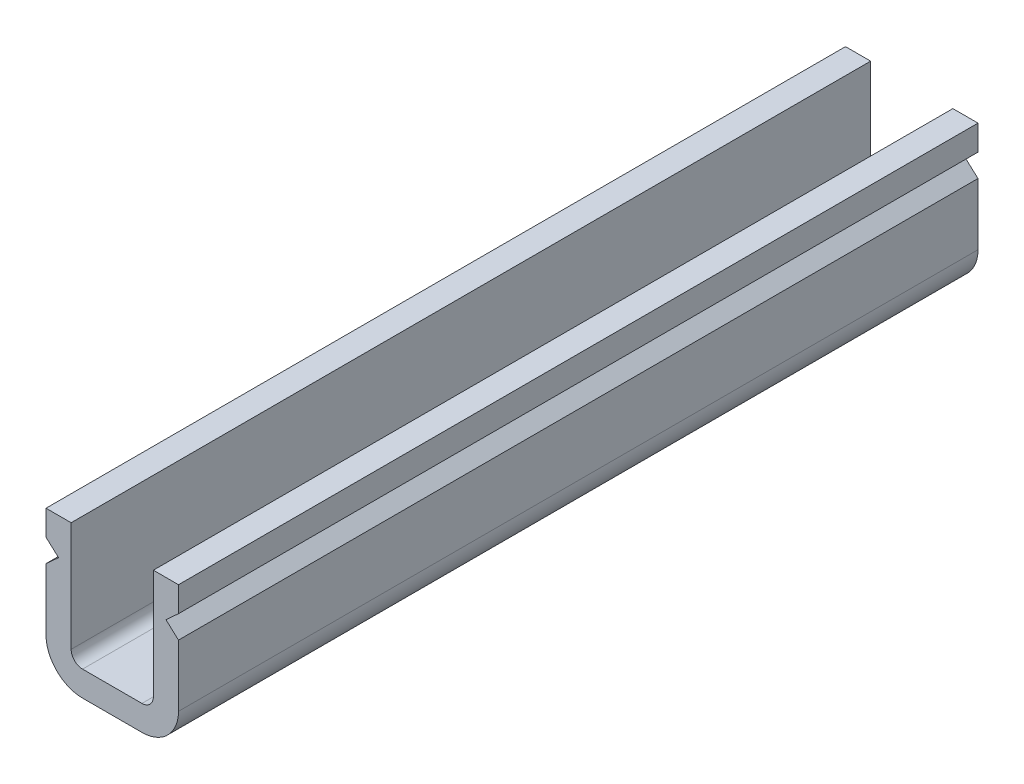
ISO-10303-21;
HEADER;
FILE_DESCRIPTION(('STEP AP214'),'2;1');
FILE_NAME('part.step','',(''),(''),'','','');
FILE_SCHEMA(('AUTOMOTIVE_DESIGN { 1 0 10303 214 1 1 1 1 }'));
ENDSEC;
DATA;
#1=APPLICATION_CONTEXT('core data for automotive mechanical design processes');
#2=APPLICATION_PROTOCOL_DEFINITION('international standard','automotive_design',2000,#1);
#3=PRODUCT_CONTEXT('',#1,'mechanical');
#4=PRODUCT('Part','Part','',(#3));
#5=PRODUCT_RELATED_PRODUCT_CATEGORY('part','',(#4));
#6=PRODUCT_DEFINITION_FORMATION('','',#4);
#7=PRODUCT_DEFINITION_CONTEXT('part definition',#1,'design');
#8=PRODUCT_DEFINITION('design','',#6,#7);
#9=PRODUCT_DEFINITION_SHAPE('','',#8);
#10=(LENGTH_UNIT() NAMED_UNIT(*) SI_UNIT(.MILLI.,.METRE.));
#11=(NAMED_UNIT(*) PLANE_ANGLE_UNIT() SI_UNIT($,.RADIAN.));
#12=(NAMED_UNIT(*) SI_UNIT($,.STERADIAN.) SOLID_ANGLE_UNIT());
#13=UNCERTAINTY_MEASURE_WITH_UNIT(LENGTH_MEASURE(1.E-05),#10,'distance_accuracy_value','');
#14=(GEOMETRIC_REPRESENTATION_CONTEXT(3) GLOBAL_UNCERTAINTY_ASSIGNED_CONTEXT((#13)) GLOBAL_UNIT_ASSIGNED_CONTEXT((#10,
#11,#12)) REPRESENTATION_CONTEXT('',''));
#15=CARTESIAN_POINT('',(0.,0.,0.));
#16=DIRECTION('',(0.,0.,1.));
#17=DIRECTION('',(1.,0.,0.));
#18=AXIS2_PLACEMENT_3D('',#15,#16,#17);
#19=CARTESIAN_POINT('',(3.2,-2.1,35.));
#20=DIRECTION('',(0.,-1.,0.));
#21=DIRECTION('',(0.,0.,-1.));
#22=AXIS2_PLACEMENT_3D('',#19,#20,#21);
#23=PLANE('',#22);
#24=DIRECTION('',(-1.,0.,0.));
#25=VECTOR('',#24,1.);
#26=CARTESIAN_POINT('',(3.2,-2.1,0.));
#27=LINE('',#26,#25);
#28=CARTESIAN_POINT('',(3.2,-2.1,0.));
#29=VERTEX_POINT('',#28);
#30=CARTESIAN_POINT('',(2.1,-2.1,0.));
#31=VERTEX_POINT('',#30);
#32=EDGE_CURVE('E186',#29,#31,#27,.T.);
#33=ORIENTED_EDGE('',*,*,#32,.T.);
#34=DIRECTION('',(0.,0.,-1.));
#35=VECTOR('',#34,1.);
#36=CARTESIAN_POINT('',(2.1,-2.1,35.));
#37=LINE('',#36,#35);
#38=CARTESIAN_POINT('',(2.1,-2.1,35.));
#39=VERTEX_POINT('',#38);
#40=EDGE_CURVE('E11',#39,#31,#37,.T.);
#41=ORIENTED_EDGE('',*,*,#40,.F.);
#42=DIRECTION('',(-1.,0.,0.));
#43=VECTOR('',#42,1.);
#44=CARTESIAN_POINT('',(3.2,-2.1,35.));
#45=LINE('',#44,#43);
#46=CARTESIAN_POINT('',(3.2,-2.1,35.));
#47=VERTEX_POINT('',#46);
#48=EDGE_CURVE('E220',#47,#39,#45,.T.);
#49=ORIENTED_EDGE('',*,*,#48,.F.);
#50=DIRECTION('',(0.,0.,-1.));
#51=VECTOR('',#50,1.);
#52=CARTESIAN_POINT('',(3.2,-2.1,35.));
#53=LINE('',#52,#51);
#54=EDGE_CURVE('E182',#47,#29,#53,.T.);
#55=ORIENTED_EDGE('',*,*,#54,.T.);
#56=EDGE_LOOP('',(#33,#41,#49,#55));
#57=FACE_BOUND('',#56,.T.);
#58=ADVANCED_FACE('F30',(#57),#23,.F.);
#59=CARTESIAN_POINT('',(2.1,-2.1,35.));
#60=DIRECTION('',(1.,0.,0.));
#61=DIRECTION('',(0.,1.,0.));
#62=AXIS2_PLACEMENT_3D('',#59,#60,#61);
#63=PLANE('',#62);
#64=DIRECTION('',(0.,-1.,0.));
#65=VECTOR('',#64,1.);
#66=CARTESIAN_POINT('',(2.1,-2.1,0.));
#67=LINE('',#66,#65);
#68=CARTESIAN_POINT('',(2.10000000000001,-3.2,0.));
#69=VERTEX_POINT('',#68);
#70=EDGE_CURVE('E189',#31,#69,#67,.T.);
#71=ORIENTED_EDGE('',*,*,#70,.T.);
#72=DIRECTION('',(0.,0.,-1.));
#73=VECTOR('',#72,1.);
#74=CARTESIAN_POINT('',(2.10000000000001,-3.2,35.));
#75=LINE('',#74,#73);
#76=CARTESIAN_POINT('',(2.10000000000001,-3.2,35.));
#77=VERTEX_POINT('',#76);
#78=EDGE_CURVE('E38',#77,#69,#75,.T.);
#79=ORIENTED_EDGE('',*,*,#78,.F.);
#80=DIRECTION('',(0.,-1.,0.));
#81=VECTOR('',#80,1.);
#82=CARTESIAN_POINT('',(2.1,-2.1,35.));
#83=LINE('',#82,#81);
#84=EDGE_CURVE('E119',#39,#77,#83,.T.);
#85=ORIENTED_EDGE('',*,*,#84,.F.);
#86=ORIENTED_EDGE('',*,*,#40,.T.);
#87=EDGE_LOOP('',(#71,#79,#85,#86));
#88=FACE_BOUND('',#87,.T.);
#89=ADVANCED_FACE('F328',(#88),#63,.F.);
#90=CARTESIAN_POINT('',(2.10000000000001,-3.2,35.));
#91=DIRECTION('',(0.672672793996314,0.739940073395943,0.));
#92=DIRECTION('',(-0.739940073395943,0.672672793996314,0.));
#93=AXIS2_PLACEMENT_3D('',#90,#91,#92);
#94=PLANE('',#93);
#95=DIRECTION('',(0.739940073395943,-0.672672793996314,0.));
#96=VECTOR('',#95,1.);
#97=CARTESIAN_POINT('',(2.10000000000001,-3.2,0.));
#98=LINE('',#97,#96);
#99=CARTESIAN_POINT('',(2.65,-3.7,0.));
#100=VERTEX_POINT('',#99);
#101=EDGE_CURVE('E191',#69,#100,#98,.T.);
#102=ORIENTED_EDGE('',*,*,#101,.T.);
#103=DIRECTION('',(0.,0.,-1.));
#104=VECTOR('',#103,1.);
#105=CARTESIAN_POINT('',(2.65,-3.7,35.));
#106=LINE('',#105,#104);
#107=CARTESIAN_POINT('',(2.65,-3.7,35.));
#108=VERTEX_POINT('',#107);
#109=EDGE_CURVE('E257',#108,#100,#106,.T.);
#110=ORIENTED_EDGE('',*,*,#109,.F.);
#111=DIRECTION('',(0.739940073395943,-0.672672793996314,0.));
#112=VECTOR('',#111,1.);
#113=CARTESIAN_POINT('',(2.10000000000001,-3.2,35.));
#114=LINE('',#113,#112);
#115=EDGE_CURVE('E265',#77,#108,#114,.T.);
#116=ORIENTED_EDGE('',*,*,#115,.F.);
#117=ORIENTED_EDGE('',*,*,#78,.T.);
#118=EDGE_LOOP('',(#102,#110,#116,#117));
#119=FACE_BOUND('',#118,.T.);
#120=ADVANCED_FACE('F263',(#119),#94,.F.);
#121=CARTESIAN_POINT('',(2.10000000000001,-4.2,35.));
#122=DIRECTION('',(0.672672793996314,-0.739940073395943,0.));
#123=DIRECTION('',(0.739940073395943,0.672672793996314,0.));
#124=AXIS2_PLACEMENT_3D('',#121,#122,#123);
#125=PLANE('',#124);
#126=DIRECTION('',(-0.739940073395943,-0.672672793996314,0.));
#127=VECTOR('',#126,1.);
#128=CARTESIAN_POINT('',(2.10000000000001,-4.2,0.));
#129=LINE('',#128,#127);
#130=CARTESIAN_POINT('',(2.10000000000001,-4.2,0.));
#131=VERTEX_POINT('',#130);
#132=EDGE_CURVE('E193',#100,#131,#129,.T.);
#133=ORIENTED_EDGE('',*,*,#132,.T.);
#134=DIRECTION('',(0.,0.,-1.));
#135=VECTOR('',#134,1.);
#136=CARTESIAN_POINT('',(2.10000000000001,-4.2,35.));
#137=LINE('',#136,#135);
#138=CARTESIAN_POINT('',(2.10000000000001,-4.2,35.));
#139=VERTEX_POINT('',#138);
#140=EDGE_CURVE('E254',#139,#131,#137,.T.);
#141=ORIENTED_EDGE('',*,*,#140,.F.);
#142=DIRECTION('',(-0.739940073395943,-0.672672793996314,0.));
#143=VECTOR('',#142,1.);
#144=CARTESIAN_POINT('',(2.10000000000001,-4.2,35.));
#145=LINE('',#144,#143);
#146=EDGE_CURVE('E283',#108,#139,#145,.T.);
#147=ORIENTED_EDGE('',*,*,#146,.F.);
#148=ORIENTED_EDGE('',*,*,#109,.T.);
#149=EDGE_LOOP('',(#133,#141,#147,#148));
#150=FACE_BOUND('',#149,.T.);
#151=ADVANCED_FACE('F274',(#150),#125,.F.);
#152=CARTESIAN_POINT('',(2.10000000000001,-4.2,35.));
#153=DIRECTION('',(1.,0.,0.));
#154=DIRECTION('',(0.,1.,0.));
#155=AXIS2_PLACEMENT_3D('',#152,#153,#154);
#156=PLANE('',#155);
#157=DIRECTION('',(0.,-1.,0.));
#158=VECTOR('',#157,1.);
#159=CARTESIAN_POINT('',(2.10000000000001,-4.2,0.));
#160=LINE('',#159,#158);
#161=CARTESIAN_POINT('',(2.1,-6.89999999999999,0.));
#162=VERTEX_POINT('',#161);
#163=EDGE_CURVE('E195',#131,#162,#160,.T.);
#164=ORIENTED_EDGE('',*,*,#163,.T.);
#165=DIRECTION('',(0.,0.,-1.));
#166=VECTOR('',#165,1.);
#167=CARTESIAN_POINT('',(2.1,-6.89999999999999,35.));
#168=LINE('',#167,#166);
#169=CARTESIAN_POINT('',(2.1,-6.89999999999999,35.));
#170=VERTEX_POINT('',#169);
#171=EDGE_CURVE('E251',#170,#162,#168,.T.);
#172=ORIENTED_EDGE('',*,*,#171,.F.);
#173=DIRECTION('',(0.,-1.,0.));
#174=VECTOR('',#173,1.);
#175=CARTESIAN_POINT('',(2.10000000000001,-4.2,35.));
#176=LINE('',#175,#174);
#177=EDGE_CURVE('E280',#139,#170,#176,.T.);
#178=ORIENTED_EDGE('',*,*,#177,.F.);
#179=ORIENTED_EDGE('',*,*,#140,.T.);
#180=EDGE_LOOP('',(#164,#172,#178,#179));
#181=FACE_BOUND('',#180,.T.);
#182=ADVANCED_FACE('F278',(#181),#156,.F.);
#183=CARTESIAN_POINT('',(3.7,-6.9,35.));
#184=DIRECTION('',(0.,0.,-1.));
#185=DIRECTION('',(-1.,0.,0.));
#186=AXIS2_PLACEMENT_3D('',#183,#184,#185);
#187=CYLINDRICAL_SURFACE('',#186,1.6);
#188=CARTESIAN_POINT('',(3.7,-6.9,0.));
#189=DIRECTION('',(0.,0.,1.));
#190=DIRECTION('',(1.,0.,0.));
#191=AXIS2_PLACEMENT_3D('',#188,#189,#190);
#192=CIRCLE('',#191,1.6);
#193=CARTESIAN_POINT('',(3.70000000000001,-8.5,0.));
#194=VERTEX_POINT('',#193);
#195=EDGE_CURVE('E197',#162,#194,#192,.T.);
#196=ORIENTED_EDGE('',*,*,#195,.T.);
#197=DIRECTION('',(0.,0.,-1.));
#198=VECTOR('',#197,1.);
#199=CARTESIAN_POINT('',(3.70000000000001,-8.5,35.));
#200=LINE('',#199,#198);
#201=CARTESIAN_POINT('',(3.70000000000001,-8.5,35.));
#202=VERTEX_POINT('',#201);
#203=EDGE_CURVE('E248',#202,#194,#200,.T.);
#204=ORIENTED_EDGE('',*,*,#203,.F.);
#205=CARTESIAN_POINT('',(3.7,-6.9,35.));
#206=DIRECTION('',(0.,0.,1.));
#207=DIRECTION('',(1.,0.,0.));
#208=AXIS2_PLACEMENT_3D('',#205,#206,#207);
#209=CIRCLE('',#208,1.6);
#210=EDGE_CURVE('E282',#170,#202,#209,.T.);
#211=ORIENTED_EDGE('',*,*,#210,.F.);
#212=ORIENTED_EDGE('',*,*,#171,.T.);
#213=EDGE_LOOP('',(#196,#204,#211,#212));
#214=FACE_BOUND('',#213,.T.);
#215=ADVANCED_FACE('F341',(#214),#187,.T.);
#216=CARTESIAN_POINT('',(3.70000000000001,-8.5,35.));
#217=DIRECTION('',(0.,1.,0.));
#218=DIRECTION('',(0.,0.,1.));
#219=AXIS2_PLACEMENT_3D('',#216,#217,#218);
#220=PLANE('',#219);
#221=DIRECTION('',(1.,0.,0.));
#222=VECTOR('',#221,1.);
#223=CARTESIAN_POINT('',(3.70000000000001,-8.5,0.));
#224=LINE('',#223,#222);
#225=CARTESIAN_POINT('',(6.29999999999999,-8.5,0.));
#226=VERTEX_POINT('',#225);
#227=EDGE_CURVE('E199',#194,#226,#224,.T.);
#228=ORIENTED_EDGE('',*,*,#227,.T.);
#229=DIRECTION('',(0.,0.,-1.));
#230=VECTOR('',#229,1.);
#231=CARTESIAN_POINT('',(6.29999999999999,-8.5,35.));
#232=LINE('',#231,#230);
#233=CARTESIAN_POINT('',(6.29999999999999,-8.5,35.));
#234=VERTEX_POINT('',#233);
#235=EDGE_CURVE('E245',#234,#226,#232,.T.);
#236=ORIENTED_EDGE('',*,*,#235,.F.);
#237=DIRECTION('',(1.,0.,0.));
#238=VECTOR('',#237,1.);
#239=CARTESIAN_POINT('',(3.70000000000001,-8.5,35.));
#240=LINE('',#239,#238);
#241=EDGE_CURVE('E285',#202,#234,#240,.T.);
#242=ORIENTED_EDGE('',*,*,#241,.F.);
#243=ORIENTED_EDGE('',*,*,#203,.T.);
#244=EDGE_LOOP('',(#228,#236,#242,#243));
#245=FACE_BOUND('',#244,.T.);
#246=ADVANCED_FACE('F344',(#245),#220,.F.);
#247=CARTESIAN_POINT('',(6.3,-6.9,35.));
#248=DIRECTION('',(0.,0.,-1.));
#249=DIRECTION('',(-1.,0.,0.));
#250=AXIS2_PLACEMENT_3D('',#247,#248,#249);
#251=CYLINDRICAL_SURFACE('',#250,1.6);
#252=CARTESIAN_POINT('',(6.3,-6.9,0.));
#253=DIRECTION('',(0.,0.,1.));
#254=DIRECTION('',(1.,0.,0.));
#255=AXIS2_PLACEMENT_3D('',#252,#253,#254);
#256=CIRCLE('',#255,1.6);
#257=CARTESIAN_POINT('',(7.9,-6.89999999999999,0.));
#258=VERTEX_POINT('',#257);
#259=EDGE_CURVE('E201',#226,#258,#256,.T.);
#260=ORIENTED_EDGE('',*,*,#259,.T.);
#261=DIRECTION('',(0.,0.,-1.));
#262=VECTOR('',#261,1.);
#263=CARTESIAN_POINT('',(7.9,-6.89999999999999,35.));
#264=LINE('',#263,#262);
#265=CARTESIAN_POINT('',(7.9,-6.89999999999999,35.));
#266=VERTEX_POINT('',#265);
#267=EDGE_CURVE('E242',#266,#258,#264,.T.);
#268=ORIENTED_EDGE('',*,*,#267,.F.);
#269=CARTESIAN_POINT('',(6.3,-6.9,35.));
#270=DIRECTION('',(0.,0.,1.));
#271=DIRECTION('',(1.,0.,0.));
#272=AXIS2_PLACEMENT_3D('',#269,#270,#271);
#273=CIRCLE('',#272,1.6);
#274=EDGE_CURVE('E291',#234,#266,#273,.T.);
#275=ORIENTED_EDGE('',*,*,#274,.F.);
#276=ORIENTED_EDGE('',*,*,#235,.T.);
#277=EDGE_LOOP('',(#260,#268,#275,#276));
#278=FACE_BOUND('',#277,.T.);
#279=ADVANCED_FACE('F348',(#278),#251,.T.);
#280=CARTESIAN_POINT('',(7.9,-6.89999999999999,35.));
#281=DIRECTION('',(-1.,0.,0.));
#282=DIRECTION('',(0.,-1.,0.));
#283=AXIS2_PLACEMENT_3D('',#280,#281,#282);
#284=PLANE('',#283);
#285=DIRECTION('',(0.,1.,0.));
#286=VECTOR('',#285,1.);
#287=CARTESIAN_POINT('',(7.9,-6.89999999999999,0.));
#288=LINE('',#287,#286);
#289=CARTESIAN_POINT('',(7.9,-4.2,0.));
#290=VERTEX_POINT('',#289);
#291=EDGE_CURVE('E203',#258,#290,#288,.T.);
#292=ORIENTED_EDGE('',*,*,#291,.T.);
#293=DIRECTION('',(0.,0.,-1.));
#294=VECTOR('',#293,1.);
#295=CARTESIAN_POINT('',(7.9,-4.2,35.));
#296=LINE('',#295,#294);
#297=CARTESIAN_POINT('',(7.9,-4.2,35.));
#298=VERTEX_POINT('',#297);
#299=EDGE_CURVE('E239',#298,#290,#296,.T.);
#300=ORIENTED_EDGE('',*,*,#299,.F.);
#301=DIRECTION('',(0.,1.,0.));
#302=VECTOR('',#301,1.);
#303=CARTESIAN_POINT('',(7.9,-6.89999999999999,35.));
#304=LINE('',#303,#302);
#305=EDGE_CURVE('E293',#266,#298,#304,.T.);
#306=ORIENTED_EDGE('',*,*,#305,.F.);
#307=ORIENTED_EDGE('',*,*,#267,.T.);
#308=EDGE_LOOP('',(#292,#300,#306,#307));
#309=FACE_BOUND('',#308,.T.);
#310=ADVANCED_FACE('F352',(#309),#284,.F.);
#311=CARTESIAN_POINT('',(7.9,-4.2,35.));
#312=DIRECTION('',(-0.672672793996314,-0.739940073395943,0.));
#313=DIRECTION('',(0.739940073395943,-0.672672793996314,0.));
#314=AXIS2_PLACEMENT_3D('',#311,#312,#313);
#315=PLANE('',#314);
#316=DIRECTION('',(-0.739940073395943,0.672672793996314,0.));
#317=VECTOR('',#316,1.);
#318=CARTESIAN_POINT('',(7.9,-4.2,0.));
#319=LINE('',#318,#317);
#320=CARTESIAN_POINT('',(7.35,-3.7,0.));
#321=VERTEX_POINT('',#320);
#322=EDGE_CURVE('E205',#290,#321,#319,.T.);
#323=ORIENTED_EDGE('',*,*,#322,.T.);
#324=DIRECTION('',(0.,0.,-1.));
#325=VECTOR('',#324,1.);
#326=CARTESIAN_POINT('',(7.35,-3.7,35.));
#327=LINE('',#326,#325);
#328=CARTESIAN_POINT('',(7.35,-3.7,35.));
#329=VERTEX_POINT('',#328);
#330=EDGE_CURVE('E236',#329,#321,#327,.T.);
#331=ORIENTED_EDGE('',*,*,#330,.F.);
#332=DIRECTION('',(-0.739940073395943,0.672672793996314,0.));
#333=VECTOR('',#332,1.);
#334=CARTESIAN_POINT('',(7.9,-4.2,35.));
#335=LINE('',#334,#333);
#336=EDGE_CURVE('E295',#298,#329,#335,.T.);
#337=ORIENTED_EDGE('',*,*,#336,.F.);
#338=ORIENTED_EDGE('',*,*,#299,.T.);
#339=EDGE_LOOP('',(#323,#331,#337,#338));
#340=FACE_BOUND('',#339,.T.);
#341=ADVANCED_FACE('F356',(#340),#315,.F.);
#342=CARTESIAN_POINT('',(7.9,-3.2,35.));
#343=DIRECTION('',(-0.672672793996314,0.739940073395943,0.));
#344=DIRECTION('',(-0.739940073395943,-0.672672793996314,0.));
#345=AXIS2_PLACEMENT_3D('',#342,#343,#344);
#346=PLANE('',#345);
#347=DIRECTION('',(0.739940073395943,0.672672793996314,0.));
#348=VECTOR('',#347,1.);
#349=CARTESIAN_POINT('',(7.9,-3.2,0.));
#350=LINE('',#349,#348);
#351=CARTESIAN_POINT('',(7.9,-3.2,0.));
#352=VERTEX_POINT('',#351);
#353=EDGE_CURVE('E207',#321,#352,#350,.T.);
#354=ORIENTED_EDGE('',*,*,#353,.T.);
#355=DIRECTION('',(0.,0.,-1.));
#356=VECTOR('',#355,1.);
#357=CARTESIAN_POINT('',(7.9,-3.2,35.));
#358=LINE('',#357,#356);
#359=CARTESIAN_POINT('',(7.9,-3.2,35.));
#360=VERTEX_POINT('',#359);
#361=EDGE_CURVE('E233',#360,#352,#358,.T.);
#362=ORIENTED_EDGE('',*,*,#361,.F.);
#363=DIRECTION('',(0.739940073395943,0.672672793996314,0.));
#364=VECTOR('',#363,1.);
#365=CARTESIAN_POINT('',(7.9,-3.2,35.));
#366=LINE('',#365,#364);
#367=EDGE_CURVE('E297',#329,#360,#366,.T.);
#368=ORIENTED_EDGE('',*,*,#367,.F.);
#369=ORIENTED_EDGE('',*,*,#330,.T.);
#370=EDGE_LOOP('',(#354,#362,#368,#369));
#371=FACE_BOUND('',#370,.T.);
#372=ADVANCED_FACE('F360',(#371),#346,.F.);
#373=CARTESIAN_POINT('',(7.9,-3.2,35.));
#374=DIRECTION('',(-1.,0.,0.));
#375=DIRECTION('',(0.,-1.,0.));
#376=AXIS2_PLACEMENT_3D('',#373,#374,#375);
#377=PLANE('',#376);
#378=DIRECTION('',(0.,1.,0.));
#379=VECTOR('',#378,1.);
#380=CARTESIAN_POINT('',(7.9,-3.2,0.));
#381=LINE('',#380,#379);
#382=CARTESIAN_POINT('',(7.9,-2.1,0.));
#383=VERTEX_POINT('',#382);
#384=EDGE_CURVE('E209',#352,#383,#381,.T.);
#385=ORIENTED_EDGE('',*,*,#384,.T.);
#386=DIRECTION('',(0.,0.,-1.));
#387=VECTOR('',#386,1.);
#388=CARTESIAN_POINT('',(7.9,-2.1,35.));
#389=LINE('',#388,#387);
#390=CARTESIAN_POINT('',(7.9,-2.1,35.));
#391=VERTEX_POINT('',#390);
#392=EDGE_CURVE('E230',#391,#383,#389,.T.);
#393=ORIENTED_EDGE('',*,*,#392,.F.);
#394=DIRECTION('',(0.,1.,0.));
#395=VECTOR('',#394,1.);
#396=CARTESIAN_POINT('',(7.9,-3.2,35.));
#397=LINE('',#396,#395);
#398=EDGE_CURVE('E299',#360,#391,#397,.T.);
#399=ORIENTED_EDGE('',*,*,#398,.F.);
#400=ORIENTED_EDGE('',*,*,#361,.T.);
#401=EDGE_LOOP('',(#385,#393,#399,#400));
#402=FACE_BOUND('',#401,.T.);
#403=ADVANCED_FACE('F364',(#402),#377,.F.);
#404=CARTESIAN_POINT('',(7.9,-2.1,35.));
#405=DIRECTION('',(0.,-1.,0.));
#406=DIRECTION('',(1.,0.,0.));
#407=AXIS2_PLACEMENT_3D('',#404,#405,#406);
#408=PLANE('',#407);
#409=DIRECTION('',(-1.,0.,0.));
#410=VECTOR('',#409,1.);
#411=CARTESIAN_POINT('',(7.9,-2.1,0.));
#412=LINE('',#411,#410);
#413=CARTESIAN_POINT('',(6.8,-2.1,0.));
#414=VERTEX_POINT('',#413);
#415=EDGE_CURVE('E211',#383,#414,#412,.T.);
#416=ORIENTED_EDGE('',*,*,#415,.T.);
#417=DIRECTION('',(0.,0.,-1.));
#418=VECTOR('',#417,1.);
#419=CARTESIAN_POINT('',(6.8,-2.1,35.));
#420=LINE('',#419,#418);
#421=CARTESIAN_POINT('',(6.8,-2.1,35.));
#422=VERTEX_POINT('',#421);
#423=EDGE_CURVE('E227',#422,#414,#420,.T.);
#424=ORIENTED_EDGE('',*,*,#423,.F.);
#425=DIRECTION('',(-1.,0.,0.));
#426=VECTOR('',#425,1.);
#427=CARTESIAN_POINT('',(7.9,-2.1,35.));
#428=LINE('',#427,#426);
#429=EDGE_CURVE('E301',#391,#422,#428,.T.);
#430=ORIENTED_EDGE('',*,*,#429,.F.);
#431=ORIENTED_EDGE('',*,*,#392,.T.);
#432=EDGE_LOOP('',(#416,#424,#430,#431));
#433=FACE_BOUND('',#432,.T.);
#434=ADVANCED_FACE('F368',(#433),#408,.F.);
#435=CARTESIAN_POINT('',(6.8,-6.9,35.));
#436=DIRECTION('',(1.,0.,0.));
#437=DIRECTION('',(0.,0.,-1.));
#438=AXIS2_PLACEMENT_3D('',#435,#436,#437);
#439=PLANE('',#438);
#440=DIRECTION('',(0.,-1.,0.));
#441=VECTOR('',#440,1.);
#442=CARTESIAN_POINT('',(6.8,-6.9,0.));
#443=LINE('',#442,#441);
#444=CARTESIAN_POINT('',(6.8,-6.9,0.));
#445=VERTEX_POINT('',#444);
#446=EDGE_CURVE('E213',#414,#445,#443,.T.);
#447=ORIENTED_EDGE('',*,*,#446,.T.);
#448=DIRECTION('',(0.,0.,-1.));
#449=VECTOR('',#448,1.);
#450=CARTESIAN_POINT('',(6.8,-6.9,35.));
#451=LINE('',#450,#449);
#452=CARTESIAN_POINT('',(6.8,-6.9,35.));
#453=VERTEX_POINT('',#452);
#454=EDGE_CURVE('E224',#453,#445,#451,.T.);
#455=ORIENTED_EDGE('',*,*,#454,.F.);
#456=DIRECTION('',(0.,-1.,0.));
#457=VECTOR('',#456,1.);
#458=CARTESIAN_POINT('',(6.8,-6.9,35.));
#459=LINE('',#458,#457);
#460=EDGE_CURVE('E303',#422,#453,#459,.T.);
#461=ORIENTED_EDGE('',*,*,#460,.F.);
#462=ORIENTED_EDGE('',*,*,#423,.T.);
#463=EDGE_LOOP('',(#447,#455,#461,#462));
#464=FACE_BOUND('',#463,.T.);
#465=ADVANCED_FACE('F309',(#464),#439,.F.);
#466=CARTESIAN_POINT('',(6.3,-6.9,35.));
#467=DIRECTION('',(0.,0.,-1.));
#468=DIRECTION('',(-1.,0.,0.));
#469=AXIS2_PLACEMENT_3D('',#466,#467,#468);
#470=CYLINDRICAL_SURFACE('',#469,0.5);
#471=CARTESIAN_POINT('',(6.3,-6.9,0.));
#472=DIRECTION('',(0.,0.,-1.));
#473=DIRECTION('',(-1.,0.,0.));
#474=AXIS2_PLACEMENT_3D('',#471,#472,#473);
#475=CIRCLE('',#474,0.5);
#476=CARTESIAN_POINT('',(6.3,-7.4,0.));
#477=VERTEX_POINT('',#476);
#478=EDGE_CURVE('E215',#445,#477,#475,.T.);
#479=ORIENTED_EDGE('',*,*,#478,.T.);
#480=DIRECTION('',(0.,0.,-1.));
#481=VECTOR('',#480,1.);
#482=CARTESIAN_POINT('',(6.3,-7.4,35.));
#483=LINE('',#482,#481);
#484=CARTESIAN_POINT('',(6.3,-7.4,35.));
#485=VERTEX_POINT('',#484);
#486=EDGE_CURVE('E177',#485,#477,#483,.T.);
#487=ORIENTED_EDGE('',*,*,#486,.F.);
#488=CARTESIAN_POINT('',(6.3,-6.9,35.));
#489=DIRECTION('',(0.,0.,-1.));
#490=DIRECTION('',(-1.,0.,0.));
#491=AXIS2_PLACEMENT_3D('',#488,#489,#490);
#492=CIRCLE('',#491,0.5);
#493=EDGE_CURVE('E168',#453,#485,#492,.T.);
#494=ORIENTED_EDGE('',*,*,#493,.F.);
#495=ORIENTED_EDGE('',*,*,#454,.T.);
#496=EDGE_LOOP('',(#479,#487,#494,#495));
#497=FACE_BOUND('',#496,.T.);
#498=ADVANCED_FACE('F313',(#497),#470,.F.);
#499=CARTESIAN_POINT('',(3.7,-7.4,35.));
#500=DIRECTION('',(0.,-1.,0.));
#501=DIRECTION('',(0.,0.,-1.));
#502=AXIS2_PLACEMENT_3D('',#499,#500,#501);
#503=PLANE('',#502);
#504=DIRECTION('',(-1.,0.,0.));
#505=VECTOR('',#504,1.);
#506=CARTESIAN_POINT('',(3.7,-7.4,0.));
#507=LINE('',#506,#505);
#508=CARTESIAN_POINT('',(3.7,-7.4,0.));
#509=VERTEX_POINT('',#508);
#510=EDGE_CURVE('E176',#477,#509,#507,.T.);
#511=ORIENTED_EDGE('',*,*,#510,.T.);
#512=DIRECTION('',(0.,0.,-1.));
#513=VECTOR('',#512,1.);
#514=CARTESIAN_POINT('',(3.7,-7.4,35.));
#515=LINE('',#514,#513);
#516=CARTESIAN_POINT('',(3.7,-7.4,35.));
#517=VERTEX_POINT('',#516);
#518=EDGE_CURVE('E173',#517,#509,#515,.T.);
#519=ORIENTED_EDGE('',*,*,#518,.F.);
#520=DIRECTION('',(-1.,0.,0.));
#521=VECTOR('',#520,1.);
#522=CARTESIAN_POINT('',(3.7,-7.4,35.));
#523=LINE('',#522,#521);
#524=EDGE_CURVE('E162',#485,#517,#523,.T.);
#525=ORIENTED_EDGE('',*,*,#524,.F.);
#526=ORIENTED_EDGE('',*,*,#486,.T.);
#527=EDGE_LOOP('',(#511,#519,#525,#526));
#528=FACE_BOUND('',#527,.T.);
#529=ADVANCED_FACE('F174',(#528),#503,.F.);
#530=CARTESIAN_POINT('',(3.7,-6.9,35.));
#531=DIRECTION('',(0.,0.,-1.));
#532=DIRECTION('',(-1.,0.,0.));
#533=AXIS2_PLACEMENT_3D('',#530,#531,#532);
#534=CYLINDRICAL_SURFACE('',#533,0.5);
#535=CARTESIAN_POINT('',(3.7,-6.9,0.));
#536=DIRECTION('',(0.,0.,-1.));
#537=DIRECTION('',(1.,0.,0.));
#538=AXIS2_PLACEMENT_3D('',#535,#536,#537);
#539=CIRCLE('',#538,0.5);
#540=CARTESIAN_POINT('',(3.2,-6.9,0.));
#541=VERTEX_POINT('',#540);
#542=EDGE_CURVE('E105',#509,#541,#539,.T.);
#543=ORIENTED_EDGE('',*,*,#542,.T.);
#544=DIRECTION('',(0.,0.,-1.));
#545=VECTOR('',#544,1.);
#546=CARTESIAN_POINT('',(3.2,-6.9,35.));
#547=LINE('',#546,#545);
#548=CARTESIAN_POINT('',(3.2,-6.9,35.));
#549=VERTEX_POINT('',#548);
#550=EDGE_CURVE('E178',#549,#541,#547,.T.);
#551=ORIENTED_EDGE('',*,*,#550,.F.);
#552=CARTESIAN_POINT('',(3.7,-6.9,35.));
#553=DIRECTION('',(0.,0.,-1.));
#554=DIRECTION('',(1.,0.,0.));
#555=AXIS2_PLACEMENT_3D('',#552,#553,#554);
#556=CIRCLE('',#555,0.5);
#557=EDGE_CURVE('E166',#517,#549,#556,.T.);
#558=ORIENTED_EDGE('',*,*,#557,.F.);
#559=ORIENTED_EDGE('',*,*,#518,.T.);
#560=EDGE_LOOP('',(#543,#551,#558,#559));
#561=FACE_BOUND('',#560,.T.);
#562=ADVANCED_FACE('F180',(#561),#534,.F.);
#563=CARTESIAN_POINT('',(3.2,-2.1,35.));
#564=DIRECTION('',(-1.,0.,0.));
#565=DIRECTION('',(0.,0.,1.));
#566=AXIS2_PLACEMENT_3D('',#563,#564,#565);
#567=PLANE('',#566);
#568=DIRECTION('',(0.,1.,0.));
#569=VECTOR('',#568,1.);
#570=CARTESIAN_POINT('',(3.2,-2.1,0.));
#571=LINE('',#570,#569);
#572=EDGE_CURVE('E111',#541,#29,#571,.T.);
#573=ORIENTED_EDGE('',*,*,#572,.T.);
#574=ORIENTED_EDGE('',*,*,#54,.F.);
#575=DIRECTION('',(0.,1.,0.));
#576=VECTOR('',#575,1.);
#577=CARTESIAN_POINT('',(3.2,-2.1,35.));
#578=LINE('',#577,#576);
#579=EDGE_CURVE('E46',#549,#47,#578,.T.);
#580=ORIENTED_EDGE('',*,*,#579,.F.);
#581=ORIENTED_EDGE('',*,*,#550,.T.);
#582=EDGE_LOOP('',(#573,#574,#580,#581));
#583=FACE_BOUND('',#582,.T.);
#584=ADVANCED_FACE('F317',(#583),#567,.F.);
#585=CARTESIAN_POINT('',(3.7,-6.9,35.));
#586=DIRECTION('',(0.,0.,1.));
#587=DIRECTION('',(1.,0.,0.));
#588=AXIS2_PLACEMENT_3D('',#585,#586,#587);
#589=PLANE('',#588);
#590=ORIENTED_EDGE('',*,*,#48,.T.);
#591=ORIENTED_EDGE('',*,*,#84,.T.);
#592=ORIENTED_EDGE('',*,*,#115,.T.);
#593=ORIENTED_EDGE('',*,*,#146,.T.);
#594=ORIENTED_EDGE('',*,*,#177,.T.);
#595=ORIENTED_EDGE('',*,*,#210,.T.);
#596=ORIENTED_EDGE('',*,*,#241,.T.);
#597=ORIENTED_EDGE('',*,*,#274,.T.);
#598=ORIENTED_EDGE('',*,*,#305,.T.);
#599=ORIENTED_EDGE('',*,*,#336,.T.);
#600=ORIENTED_EDGE('',*,*,#367,.T.);
#601=ORIENTED_EDGE('',*,*,#398,.T.);
#602=ORIENTED_EDGE('',*,*,#429,.T.);
#603=ORIENTED_EDGE('',*,*,#460,.T.);
#604=ORIENTED_EDGE('',*,*,#493,.T.);
#605=ORIENTED_EDGE('',*,*,#524,.T.);
#606=ORIENTED_EDGE('',*,*,#557,.T.);
#607=ORIENTED_EDGE('',*,*,#579,.T.);
#608=EDGE_LOOP('',(#590,#591,#592,#593,#594,#595,#596,#597,#598,#599,#600,#601,#602,#603,#604,
#605,#606,#607));
#609=FACE_BOUND('',#608,.T.);
#610=ADVANCED_FACE('F164',(#609),#589,.T.);
#611=CARTESIAN_POINT('',(3.7,-6.9,0.));
#612=DIRECTION('',(0.,0.,1.));
#613=DIRECTION('',(1.,0.,0.));
#614=AXIS2_PLACEMENT_3D('',#611,#612,#613);
#615=PLANE('',#614);
#616=ORIENTED_EDGE('',*,*,#32,.F.);
#617=ORIENTED_EDGE('',*,*,#572,.F.);
#618=ORIENTED_EDGE('',*,*,#542,.F.);
#619=ORIENTED_EDGE('',*,*,#510,.F.);
#620=ORIENTED_EDGE('',*,*,#478,.F.);
#621=ORIENTED_EDGE('',*,*,#446,.F.);
#622=ORIENTED_EDGE('',*,*,#415,.F.);
#623=ORIENTED_EDGE('',*,*,#384,.F.);
#624=ORIENTED_EDGE('',*,*,#353,.F.);
#625=ORIENTED_EDGE('',*,*,#322,.F.);
#626=ORIENTED_EDGE('',*,*,#291,.F.);
#627=ORIENTED_EDGE('',*,*,#259,.F.);
#628=ORIENTED_EDGE('',*,*,#227,.F.);
#629=ORIENTED_EDGE('',*,*,#195,.F.);
#630=ORIENTED_EDGE('',*,*,#163,.F.);
#631=ORIENTED_EDGE('',*,*,#132,.F.);
#632=ORIENTED_EDGE('',*,*,#101,.F.);
#633=ORIENTED_EDGE('',*,*,#70,.F.);
#634=EDGE_LOOP('',(#616,#617,#618,#619,#620,#621,#622,#623,#624,#625,#626,#627,#628,#629,#630,
#631,#632,#633));
#635=FACE_BOUND('',#634,.T.);
#636=ADVANCED_FACE('F269',(#635),#615,.F.);
#637=CLOSED_SHELL('',(#58,#89,#120,#151,#182,#215,#246,#279,#310,#341,#372,#403,#434,#465,#498,
#529,#562,#584,#610,#636));
#638=MANIFOLD_SOLID_BREP('B2',#637);
#639=ADVANCED_BREP_SHAPE_REPRESENTATION('',(#18,#638),#14);
#640=SHAPE_DEFINITION_REPRESENTATION(#9,#639);
ENDSEC;
END-ISO-10303-21;
